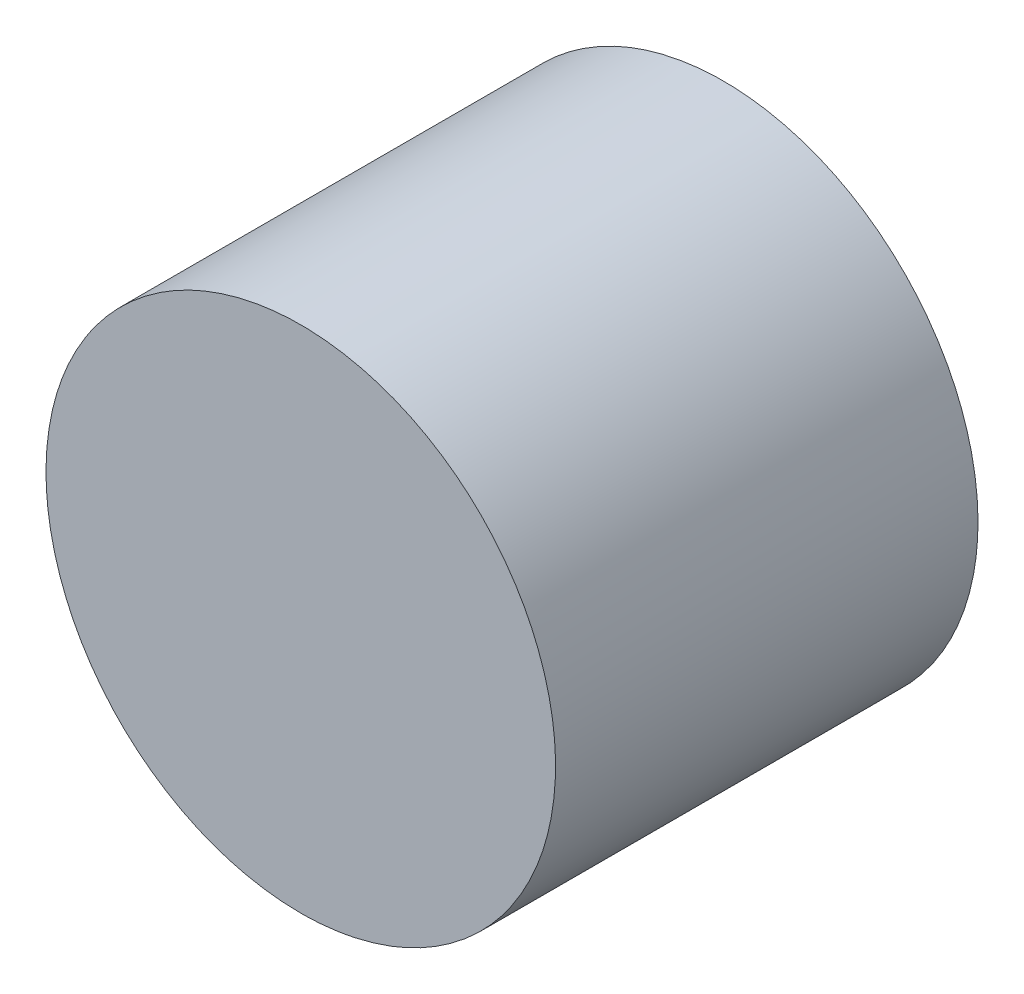
ISO-10303-21;
HEADER;
FILE_DESCRIPTION(('STEP AP214'),'2;1');
FILE_NAME('part.step','',(''),(''),'','','');
FILE_SCHEMA(('AUTOMOTIVE_DESIGN { 1 0 10303 214 1 1 1 1 }'));
ENDSEC;
DATA;
#1=APPLICATION_CONTEXT('core data for automotive mechanical design processes');
#2=APPLICATION_PROTOCOL_DEFINITION('international standard','automotive_design',2000,#1);
#3=PRODUCT_CONTEXT('',#1,'mechanical');
#4=PRODUCT('Part','Part','',(#3));
#5=PRODUCT_RELATED_PRODUCT_CATEGORY('part','',(#4));
#6=PRODUCT_DEFINITION_FORMATION('','',#4);
#7=PRODUCT_DEFINITION_CONTEXT('part definition',#1,'design');
#8=PRODUCT_DEFINITION('design','',#6,#7);
#9=PRODUCT_DEFINITION_SHAPE('','',#8);
#10=(LENGTH_UNIT() NAMED_UNIT(*) SI_UNIT(.MILLI.,.METRE.));
#11=(NAMED_UNIT(*) PLANE_ANGLE_UNIT() SI_UNIT($,.RADIAN.));
#12=(NAMED_UNIT(*) SI_UNIT($,.STERADIAN.) SOLID_ANGLE_UNIT());
#13=UNCERTAINTY_MEASURE_WITH_UNIT(LENGTH_MEASURE(1.E-05),#10,'distance_accuracy_value','');
#14=(GEOMETRIC_REPRESENTATION_CONTEXT(3) GLOBAL_UNCERTAINTY_ASSIGNED_CONTEXT((#13)) GLOBAL_UNIT_ASSIGNED_CONTEXT((#10,
#11,#12)) REPRESENTATION_CONTEXT('',''));
#15=CARTESIAN_POINT('',(0.,0.,0.));
#16=DIRECTION('',(0.,0.,1.));
#17=DIRECTION('',(1.,0.,0.));
#18=AXIS2_PLACEMENT_3D('',#15,#16,#17);
#19=CARTESIAN_POINT('',(-8.5999934574517,59.3566052942442,123.808385168912));
#20=CARTESIAN_POINT('',(-8.53270146576865,59.3566052942442,123.808385168912));
#21=CARTESIAN_POINT('',(-8.39811748240253,59.383375712987,123.808385168912));
#22=CARTESIAN_POINT('',(-8.22697529454433,59.4977292669606,123.808385168912));
#23=CARTESIAN_POINT('',(-8.11262174057071,59.6688714548188,123.808385168912));
#24=CARTESIAN_POINT('',(-8.07246611245661,59.870747429868,123.808385168912));
#25=CARTESIAN_POINT('',(-8.11262174057071,60.0726234049171,123.808385168912));
#26=CARTESIAN_POINT('',(-8.22697529454433,60.2437655927754,123.808385168912));
#27=CARTESIAN_POINT('',(-8.39811748240254,60.358119146749,123.808385168912));
#28=CARTESIAN_POINT('',(-8.5999934574517,60.3982747748631,123.808385168912));
#29=CARTESIAN_POINT('',(-8.80186943250087,60.358119146749,123.808385168912));
#30=CARTESIAN_POINT('',(-8.97301162035908,60.2437655927754,123.808385168912));
#31=CARTESIAN_POINT('',(-9.0873651743327,60.0726234049172,123.808385168912));
#32=CARTESIAN_POINT('',(-9.1275208024468,59.870747429868,123.808385168912));
#33=CARTESIAN_POINT('',(-9.0873651743327,59.6688714548188,123.808385168912));
#34=CARTESIAN_POINT('',(-8.97301162035908,59.4977292669606,123.808385168912));
#35=CARTESIAN_POINT('',(-8.80186943250087,59.383375712987,123.808385168912));
#36=CARTESIAN_POINT('',(-8.66728544913476,59.3566052942442,123.808385168912));
#37=CARTESIAN_POINT('',(-8.5999934574517,59.3566052942442,123.808385168912));
#38=B_SPLINE_CURVE_WITH_KNOTS('',3,(#19,#20,#21,#22,#23,#24,#25,#26,#27,#28,#29,#30,#31,#32,#33,
#34,#35,#36,#37),.UNSPECIFIED.,.T.,.F.,(4,1,1,1,1,1,1,1,1,1,1,1,1,1,1,1,4),(0.,
0.0625000000000002,0.125,0.187500000000001,0.25,0.312499999999999,0.375,0.4375,0.5,0.5625,0.625,
0.687500000000001,0.75,0.812499999999999,0.875,0.9375,1.),.UNSPECIFIED.);
#39=DIRECTION('',(0.,0.,1.));
#40=VECTOR('',#39,1.);
#41=SURFACE_OF_LINEAR_EXTRUSION('',#38,#40);
#42=CARTESIAN_POINT('',(-8.5999934574517,59.3566052942442,123.808385168912));
#43=CARTESIAN_POINT('',(-8.53270146576865,59.3566052942442,123.808385168912));
#44=CARTESIAN_POINT('',(-8.39811748240253,59.383375712987,123.808385168912));
#45=CARTESIAN_POINT('',(-8.22697529454433,59.4977292669606,123.808385168912));
#46=CARTESIAN_POINT('',(-8.11262174057071,59.6688714548188,123.808385168912));
#47=CARTESIAN_POINT('',(-8.07246611245661,59.870747429868,123.808385168912));
#48=CARTESIAN_POINT('',(-8.11262174057071,60.0726234049171,123.808385168912));
#49=CARTESIAN_POINT('',(-8.22697529454433,60.2437655927754,123.808385168912));
#50=CARTESIAN_POINT('',(-8.39811748240254,60.358119146749,123.808385168912));
#51=CARTESIAN_POINT('',(-8.5999934574517,60.3982747748631,123.808385168912));
#52=CARTESIAN_POINT('',(-8.80186943250087,60.358119146749,123.808385168912));
#53=CARTESIAN_POINT('',(-8.97301162035908,60.2437655927754,123.808385168912));
#54=CARTESIAN_POINT('',(-9.0873651743327,60.0726234049172,123.808385168912));
#55=CARTESIAN_POINT('',(-9.1275208024468,59.870747429868,123.808385168912));
#56=CARTESIAN_POINT('',(-9.0873651743327,59.6688714548188,123.808385168912));
#57=CARTESIAN_POINT('',(-8.97301162035908,59.4977292669606,123.808385168912));
#58=CARTESIAN_POINT('',(-8.80186943250087,59.383375712987,123.808385168912));
#59=CARTESIAN_POINT('',(-8.66728544913476,59.3566052942442,123.808385168912));
#60=CARTESIAN_POINT('',(-8.5999934574517,59.3566052942442,123.808385168912));
#61=B_SPLINE_CURVE_WITH_KNOTS('',3,(#42,#43,#44,#45,#46,#47,#48,#49,#50,#51,#52,#53,#54,#55,#56,
#57,#58,#59,#60),.UNSPECIFIED.,.T.,.F.,(4,1,1,1,1,1,1,1,1,1,1,1,1,1,1,1,4),(0.,
0.0625000000000002,0.125,0.187500000000001,0.25,0.312499999999999,0.375,0.4375,0.5,0.5625,0.625,
0.687500000000001,0.75,0.812499999999999,0.875,0.9375,1.),.UNSPECIFIED.);
#62=CARTESIAN_POINT('',(-8.5999934574517,59.3566052942442,123.808385168912));
#63=VERTEX_POINT('',#62);
#64=EDGE_CURVE('E9',#63,#63,#61,.T.);
#65=ORIENTED_EDGE('',*,*,#64,.T.);
#66=EDGE_LOOP('',(#65));
#67=FACE_BOUND('',#66,.T.);
#68=CARTESIAN_POINT('',(-8.5999934574517,59.3566052942442,124.660837467507));
#69=CARTESIAN_POINT('',(-8.60791032570006,59.3566052886788,124.660837467507));
#70=CARTESIAN_POINT('',(-8.61582705487645,59.3567905637446,124.660837467507));
#71=CARTESIAN_POINT('',(-8.63164383298798,59.3575283008755,124.660837467507));
#72=CARTESIAN_POINT('',(-8.63954388100349,59.3580807826804,124.660837467507));
#73=CARTESIAN_POINT('',(-8.65531055835132,59.3595496066018,124.660837467507));
#74=CARTESIAN_POINT('',(-8.66317718545135,59.360465972649,124.660837467507));
#75=CARTESIAN_POINT('',(-8.67886037983419,59.362659246466,124.660837467507));
#76=CARTESIAN_POINT('',(-8.68667694476544,59.363936171047,124.660837467507));
#77=CARTESIAN_POINT('',(-8.70224334390387,59.3668472604983,124.660837467507));
#78=CARTESIAN_POINT('',(-8.70999317743019,59.3684814290092,124.660837467507));
#79=CARTESIAN_POINT('',(-8.72540945393564,59.3721036952918,124.660837467507));
#80=CARTESIAN_POINT('',(-8.73307589938534,59.3740917825475,124.660837467507));
#81=CARTESIAN_POINT('',(-8.7483087124746,59.3784186324011,124.660837467507));
#82=CARTESIAN_POINT('',(-8.75587508601476,59.3807573742218,124.660837467507));
#83=CARTESIAN_POINT('',(-8.77089115704029,59.3857820662462,124.660837467507));
#84=CARTESIAN_POINT('',(-8.77834086202267,59.3884679940365,124.660837467507));
#85=CARTESIAN_POINT('',(-8.79310666797214,59.3941843627616,124.660837467507));
#86=CARTESIAN_POINT('',(-8.80042277317195,59.3972147927599,124.660837467507));
#87=CARTESIAN_POINT('',(-8.81490585777387,59.403613711184,124.660837467507));
#88=CARTESIAN_POINT('',(-8.82207283243561,59.4069822103361,124.660837467507));
#89=CARTESIAN_POINT('',(-8.83624379189913,59.4140471821933,124.660837467507));
#90=CARTESIAN_POINT('',(-8.84324776615349,59.4177436760481,124.660837467507));
#91=CARTESIAN_POINT('',(-8.85707853641886,59.4254553565625,124.660837467507));
#92=CARTESIAN_POINT('',(-8.86390532191062,59.4294705620861,124.660837467507));
#93=CARTESIAN_POINT('',(-8.87736760476604,59.4378101868597,124.660837467507));
#94=CARTESIAN_POINT('',(-8.88400309644064,59.4421346152928,124.660837467507));
#95=CARTESIAN_POINT('',(-8.89706865337682,59.4510832699645,124.660837467507));
#96=CARTESIAN_POINT('',(-8.90349872073123,59.4557074931475,124.660837467507));
#97=CARTESIAN_POINT('',(-8.91613929465255,59.4652463097937,124.660837467507));
#98=CARTESIAN_POINT('',(-8.92234981144379,59.4701608897066,124.660837467507));
#99=CARTESIAN_POINT('',(-8.93453714367976,59.4802709901018,124.660837467507));
#100=CARTESIAN_POINT('',(-8.94051397446834,59.485466492085,124.660837467507));
#101=CARTESIAN_POINT('',(-8.95221981277431,59.4961290167532,124.660837467507));
#102=CARTESIAN_POINT('',(-8.95794883359694,59.5015960248267,124.660837467507));
#103=CARTESIAN_POINT('',(-8.96914486249302,59.5127920537227,124.660837467507));
#104=CARTESIAN_POINT('',(-8.97461187056649,59.5185210745454,124.660837467507));
#105=CARTESIAN_POINT('',(-8.98527439523464,59.5302269128513,124.660837467507));
#106=CARTESIAN_POINT('',(-8.99046989721789,59.5362037436399,124.660837467507));
#107=CARTESIAN_POINT('',(-9.00057999761304,59.5483910758759,124.660837467507));
#108=CARTESIAN_POINT('',(-9.005494577526,59.5546015926671,124.660837467507));
#109=CARTESIAN_POINT('',(-9.01503339417222,59.5672421665884,124.660837467507));
#110=CARTESIAN_POINT('',(-9.01965761735519,59.5736722339429,124.660837467507));
#111=CARTESIAN_POINT('',(-9.02860627202692,59.586737790879,124.660837467507));
#112=CARTESIAN_POINT('',(-9.03293070045995,59.5933732825537,124.660837467507));
#113=CARTESIAN_POINT('',(-9.04127032523362,59.606835565409,124.660837467507));
#114=CARTESIAN_POINT('',(-9.0452855307572,59.6136623509008,124.660837467507));
#115=CARTESIAN_POINT('',(-9.05299721127161,59.6274931211662,124.660837467507));
#116=CARTESIAN_POINT('',(-9.05669370512638,59.6344970954207,124.660837467507));
#117=CARTESIAN_POINT('',(-9.06375867698356,59.6486680548839,124.660837467507));
#118=CARTESIAN_POINT('',(-9.06712717613576,59.6558350295452,124.660837467507));
#119=CARTESIAN_POINT('',(-9.07352609455977,59.6703181141483,124.660837467507));
#120=CARTESIAN_POINT('',(-9.07655652455793,59.6776342193497,124.660837467507));
#121=CARTESIAN_POINT('',(-9.08227289328337,59.6924000252949,124.660837467507));
#122=CARTESIAN_POINT('',(-9.08495882107404,59.6998497302714,124.660837467507));
#123=CARTESIAN_POINT('',(-9.0899835130973,59.7148658013129,124.660837467507));
#124=CARTESIAN_POINT('',(-9.09232225491657,59.7224321748748,124.660837467507));
#125=CARTESIAN_POINT('',(-9.09664910477422,59.7376649879046,124.660837467507));
#126=CARTESIAN_POINT('',(-9.09863719203554,59.7453314332731,124.660837467507));
#127=CARTESIAN_POINT('',(-9.10225945830283,59.7607477100004,124.660837467507));
#128=CARTESIAN_POINT('',(-9.1038936267927,59.7684975438298,124.660837467507));
#129=CARTESIAN_POINT('',(-9.10680471630138,59.7840639421402,124.660837467507));
#130=CARTESIAN_POINT('',(-9.10808164096077,59.7918805059404,124.660837467507));
#131=CARTESIAN_POINT('',(-9.11027491456358,59.8075637034133,124.660837467507));
#132=CARTESIAN_POINT('',(-9.11119128031822,59.8154303347342,124.660837467507));
#133=CARTESIAN_POINT('',(-9.11266010503895,59.8311970005507,124.660837467507));
#134=CARTESIAN_POINT('',(-9.11321258793553,59.8390970328154,124.660837467507));
#135=CARTESIAN_POINT('',(-9.11395032208375,59.8549138539584,124.660837467507));
#136=CARTESIAN_POINT('',(-9.11413559307544,59.8628306419132,124.660837467507));
#137=CARTESIAN_POINT('',(-9.11413559307544,59.8786642178228,124.660837467507));
#138=CARTESIAN_POINT('',(-9.11395032208375,59.8865810057775,124.660837467507));
#139=CARTESIAN_POINT('',(-9.11321258793553,59.9023978269206,124.660837467507));
#140=CARTESIAN_POINT('',(-9.11266010503895,59.9102978591852,124.660837467507));
#141=CARTESIAN_POINT('',(-9.11119128031821,59.9260645250017,124.660837467507));
#142=CARTESIAN_POINT('',(-9.11027491456358,59.9339311563226,124.660837467507));
#143=CARTESIAN_POINT('',(-9.10808164096077,59.9496143537955,124.660837467507));
#144=CARTESIAN_POINT('',(-9.10680471630138,59.9574309175957,124.660837467507));
#145=CARTESIAN_POINT('',(-9.1038936267927,59.9729973159062,124.660837467507));
#146=CARTESIAN_POINT('',(-9.10225945830283,59.9807471497355,124.660837467507));
#147=CARTESIAN_POINT('',(-9.09863719203554,59.9961634264628,124.660837467507));
#148=CARTESIAN_POINT('',(-9.09664910477422,60.0038298718313,124.660837467507));
#149=CARTESIAN_POINT('',(-9.09232225491657,60.0190626848612,124.660837467507));
#150=CARTESIAN_POINT('',(-9.0899835130973,60.0266290584231,124.660837467507));
#151=CARTESIAN_POINT('',(-9.08495882107404,60.0416451294645,124.660837467507));
#152=CARTESIAN_POINT('',(-9.08227289328337,60.0490948344411,124.660837467507));
#153=CARTESIAN_POINT('',(-9.07655652455792,60.0638606403863,124.660837467507));
#154=CARTESIAN_POINT('',(-9.07352609455977,60.0711767455877,124.660837467507));
#155=CARTESIAN_POINT('',(-9.06712717613576,60.0856598301907,124.660837467507));
#156=CARTESIAN_POINT('',(-9.06375867698356,60.092826804852,124.660837467507));
#157=CARTESIAN_POINT('',(-9.05669370512638,60.1069977643153,124.660837467507));
#158=CARTESIAN_POINT('',(-9.05299721127161,60.1140017385697,124.660837467507));
#159=CARTESIAN_POINT('',(-9.0452855307572,60.1278325088352,124.660837467507));
#160=CARTESIAN_POINT('',(-9.04127032523362,60.1346592943269,124.660837467507));
#161=CARTESIAN_POINT('',(-9.03293070045995,60.1481215771823,124.660837467507));
#162=CARTESIAN_POINT('',(-9.02860627202691,60.1547570688569,124.660837467507));
#163=CARTESIAN_POINT('',(-9.01965761735518,60.1678226257931,124.660837467507));
#164=CARTESIAN_POINT('',(-9.01503339417221,60.1742526931475,124.660837467507));
#165=CARTESIAN_POINT('',(-9.005494577526,60.1868932670688,124.660837467507));
#166=CARTESIAN_POINT('',(-9.00057999761304,60.1931037838601,124.660837467507));
#167=CARTESIAN_POINT('',(-8.99046989721789,60.205291116096,124.660837467507));
#168=CARTESIAN_POINT('',(-8.98527439523464,60.2112679468846,124.660837467507));
#169=CARTESIAN_POINT('',(-8.97461187056649,60.2229737851906,124.660837467507));
#170=CARTESIAN_POINT('',(-8.96914486249302,60.2287028060132,124.660837467507));
#171=CARTESIAN_POINT('',(-8.95794883359694,60.2398988349093,124.660837467507));
#172=CARTESIAN_POINT('',(-8.95221981277431,60.2453658429828,124.660837467507));
#173=CARTESIAN_POINT('',(-8.94051397446833,60.2560283676509,124.660837467507));
#174=CARTESIAN_POINT('',(-8.93453714367975,60.2612238696342,124.660837467507));
#175=CARTESIAN_POINT('',(-8.92234981144379,60.2713339700293,124.660837467507));
#176=CARTESIAN_POINT('',(-8.91613929465254,60.2762485499423,124.660837467507));
#177=CARTESIAN_POINT('',(-8.90349872073123,60.2857873665885,124.660837467507));
#178=CARTESIAN_POINT('',(-8.89706865337682,60.2904115897715,124.660837467507));
#179=CARTESIAN_POINT('',(-8.88400309644064,60.2993602444432,124.660837467507));
#180=CARTESIAN_POINT('',(-8.87736760476603,60.3036846728762,124.660837467507));
#181=CARTESIAN_POINT('',(-8.86390532191063,60.3120242976499,124.660837467507));
#182=CARTESIAN_POINT('',(-8.8570785364189,60.3160395031735,124.660837467507));
#183=CARTESIAN_POINT('',(-8.84324776615345,60.3237511836879,124.660837467507));
#184=CARTESIAN_POINT('',(-8.83624379189898,60.3274476775427,124.660837467507));
#185=CARTESIAN_POINT('',(-8.82207283243576,60.3345126493998,124.660837467507));
#186=CARTESIAN_POINT('',(-8.81490585777444,60.3378811485521,124.660837467507));
#187=CARTESIAN_POINT('',(-8.80042277317138,60.344280066976,124.660837467507));
#188=CARTESIAN_POINT('',(-8.79310666797,60.3473104969742,124.660837467507));
#189=CARTESIAN_POINT('',(-8.77834086202481,60.3530268656996,124.660837467507));
#190=CARTESIAN_POINT('',(-8.77089115704825,60.3557127934903,124.660837467507));
#191=CARTESIAN_POINT('',(-8.75587508600679,60.3607374855136,124.660837467507));
#192=CARTESIAN_POINT('',(-8.74830871244488,60.3630762273328,124.660837467507));
#193=CARTESIAN_POINT('',(-8.73307589941505,60.3674030771905,124.660837467507));
#194=CARTESIAN_POINT('',(-8.72540945404656,60.3693911644518,124.660837467507));
#195=CARTESIAN_POINT('',(-8.70999317731925,60.3730134307191,124.660837467507));
#196=CARTESIAN_POINT('',(-8.70224334348987,60.374647599209,124.660837467507));
#197=CARTESIAN_POINT('',(-8.68667694517944,60.3775586887177,124.660837467507));
#198=CARTESIAN_POINT('',(-8.67886038137925,60.3788356133771,124.660837467507));
#199=CARTESIAN_POINT('',(-8.66317718390636,60.3810288869799,124.660837467507));
#200=CARTESIAN_POINT('',(-8.65531055258547,60.3819452527345,124.660837467507));
#201=CARTESIAN_POINT('',(-8.63954388676895,60.3834140774552,124.660837467507));
#202=CARTESIAN_POINT('',(-8.63164385450432,60.3839665603518,124.660837467507));
#203=CARTESIAN_POINT('',(-8.61582703336127,60.3847042945,124.660837467507));
#204=CARTESIAN_POINT('',(-8.60791024540649,60.3848895654917,124.660837467507));
#205=CARTESIAN_POINT('',(-8.59207666949692,60.3848895654917,124.660837467507));
#206=CARTESIAN_POINT('',(-8.58415988154214,60.3847042945,124.660837467507));
#207=CARTESIAN_POINT('',(-8.56834306039909,60.3839665603518,124.660837467507));
#208=CARTESIAN_POINT('',(-8.56044302813446,60.3834140774552,124.660837467507));
#209=CARTESIAN_POINT('',(-8.54467636231794,60.3819452527345,124.660837467507));
#210=CARTESIAN_POINT('',(-8.53680973099705,60.3810288869799,124.660837467507));
#211=CARTESIAN_POINT('',(-8.52112653352416,60.378835613377,124.660837467507));
#212=CARTESIAN_POINT('',(-8.51330996972397,60.3775586887177,124.660837467507));
#213=CARTESIAN_POINT('',(-8.49774357141354,60.374647599209,124.660837467507));
#214=CARTESIAN_POINT('',(-8.48999373758416,60.3730134307191,124.660837467507));
#215=CARTESIAN_POINT('',(-8.47457746085685,60.3693911644518,124.660837467507));
#216=CARTESIAN_POINT('',(-8.46691101548835,60.3674030771905,124.660837467507));
#217=CARTESIAN_POINT('',(-8.45167820245853,60.3630762273329,124.660837467507));
#218=CARTESIAN_POINT('',(-8.44411182889661,60.3607374855136,124.660837467507));
#219=CARTESIAN_POINT('',(-8.42909575785516,60.3557127934903,124.660837467507));
#220=CARTESIAN_POINT('',(-8.42164605287861,60.3530268656996,124.660837467507));
#221=CARTESIAN_POINT('',(-8.4068802469334,60.3473104969742,124.660837467507));
#222=CARTESIAN_POINT('',(-8.39956414173203,60.3442800669761,124.660837467507));
#223=CARTESIAN_POINT('',(-8.38508105712897,60.337881148552,124.660837467507));
#224=CARTESIAN_POINT('',(-8.37791408246765,60.3345126493998,124.660837467507));
#225=CARTESIAN_POINT('',(-8.36374312300443,60.3274476775427,124.660837467507));
#226=CARTESIAN_POINT('',(-8.35673914874996,60.3237511836879,124.660837467507));
#227=CARTESIAN_POINT('',(-8.34290837848451,60.3160395031735,124.660837467507));
#228=CARTESIAN_POINT('',(-8.33608159299278,60.3120242976499,124.660837467507));
#229=CARTESIAN_POINT('',(-8.32261931013739,60.3036846728762,124.660837467507));
#230=CARTESIAN_POINT('',(-8.31598381846277,60.2993602444432,124.660837467507));
#231=CARTESIAN_POINT('',(-8.30291826152659,60.2904115897715,124.660837467507));
#232=CARTESIAN_POINT('',(-8.29648819417218,60.2857873665885,124.660837467507));
#233=CARTESIAN_POINT('',(-8.28384762025087,60.2762485499423,124.660837467507));
#234=CARTESIAN_POINT('',(-8.27763710345962,60.2713339700293,124.660837467507));
#235=CARTESIAN_POINT('',(-8.26544977122365,60.2612238696342,124.660837467507));
#236=CARTESIAN_POINT('',(-8.25947294043507,60.2560283676509,124.660837467507));
#237=CARTESIAN_POINT('',(-8.24776710212909,60.2453658429828,124.660837467507));
#238=CARTESIAN_POINT('',(-8.24203808130647,60.2398988349093,124.660837467507));
#239=CARTESIAN_POINT('',(-8.23084205241039,60.2287028060132,124.660837467507));
#240=CARTESIAN_POINT('',(-8.22537504433692,60.2229737851906,124.660837467507));
#241=CARTESIAN_POINT('',(-8.21471251966877,60.2112679468846,124.660837467507));
#242=CARTESIAN_POINT('',(-8.20951701768552,60.205291116096,124.660837467507));
#243=CARTESIAN_POINT('',(-8.19940691729037,60.1931037838601,124.660837467507));
#244=CARTESIAN_POINT('',(-8.19449233737741,60.1868932670688,124.660837467507));
#245=CARTESIAN_POINT('',(-8.1849535207312,60.1742526931475,124.660837467507));
#246=CARTESIAN_POINT('',(-8.18032929754823,60.1678226257931,124.660837467507));
#247=CARTESIAN_POINT('',(-8.1713806428765,60.1547570688569,124.660837467507));
#248=CARTESIAN_POINT('',(-8.16705621444346,60.1481215771823,124.660837467507));
#249=CARTESIAN_POINT('',(-8.15871658966979,60.1346592943269,124.660837467507));
#250=CARTESIAN_POINT('',(-8.15470138414621,60.1278325088352,124.660837467507));
#251=CARTESIAN_POINT('',(-8.1469897036318,60.1140017385697,124.660837467507));
#252=CARTESIAN_POINT('',(-8.14329320977702,60.1069977643152,124.660837467507));
#253=CARTESIAN_POINT('',(-8.13622823791985,60.092826804852,124.660837467507));
#254=CARTESIAN_POINT('',(-8.13285973876765,60.0856598301907,124.660837467507));
#255=CARTESIAN_POINT('',(-8.12646082034364,60.0711767455876,124.660837467507));
#256=CARTESIAN_POINT('',(-8.12343039034549,60.0638606403863,124.660837467507));
#257=CARTESIAN_POINT('',(-8.11771402162004,60.0490948344411,124.660837467507));
#258=CARTESIAN_POINT('',(-8.11502809382937,60.0416451294645,124.660837467507));
#259=CARTESIAN_POINT('',(-8.11000340180611,60.0266290584231,124.660837467507));
#260=CARTESIAN_POINT('',(-8.10766465998684,60.0190626848611,124.660837467507));
#261=CARTESIAN_POINT('',(-8.1033378101292,60.0038298718313,124.660837467507));
#262=CARTESIAN_POINT('',(-8.10134972286787,59.9961634264628,124.660837467507));
#263=CARTESIAN_POINT('',(-8.09772745660058,59.9807471497355,124.660837467507));
#264=CARTESIAN_POINT('',(-8.09609328811071,59.9729973159061,124.660837467507));
#265=CARTESIAN_POINT('',(-8.09318219860203,59.9574309175957,124.660837467507));
#266=CARTESIAN_POINT('',(-8.09190527394264,59.9496143537955,124.660837467507));
#267=CARTESIAN_POINT('',(-8.08971200033983,59.9339311563226,124.660837467507));
#268=CARTESIAN_POINT('',(-8.0887956345852,59.9260645250017,124.660837467507));
#269=CARTESIAN_POINT('',(-8.08732680986446,59.9102978591852,124.660837467507));
#270=CARTESIAN_POINT('',(-8.08677432696788,59.9023978269206,124.660837467507));
#271=CARTESIAN_POINT('',(-8.08603659281966,59.8865810057775,124.660837467507));
#272=CARTESIAN_POINT('',(-8.08585132182798,59.8786642178228,124.660837467507));
#273=CARTESIAN_POINT('',(-8.08585132182798,59.8628306419132,124.660837467507));
#274=CARTESIAN_POINT('',(-8.08603659281967,59.8549138539584,124.660837467507));
#275=CARTESIAN_POINT('',(-8.08677432696788,59.8390970328154,124.660837467507));
#276=CARTESIAN_POINT('',(-8.08732680986446,59.8311970005507,124.660837467507));
#277=CARTESIAN_POINT('',(-8.0887956345852,59.8154303347342,124.660837467507));
#278=CARTESIAN_POINT('',(-8.08971200033983,59.8075637034133,124.660837467507));
#279=CARTESIAN_POINT('',(-8.09190527394264,59.7918805059404,124.660837467507));
#280=CARTESIAN_POINT('',(-8.09318219860203,59.7840639421402,124.660837467507));
#281=CARTESIAN_POINT('',(-8.09609328811071,59.7684975438298,124.660837467507));
#282=CARTESIAN_POINT('',(-8.09772745660058,59.7607477100004,124.660837467507));
#283=CARTESIAN_POINT('',(-8.10134972286787,59.7453314332731,124.660837467507));
#284=CARTESIAN_POINT('',(-8.1033378101292,59.7376649879046,124.660837467507));
#285=CARTESIAN_POINT('',(-8.10766465998684,59.7224321748748,124.660837467507));
#286=CARTESIAN_POINT('',(-8.11000340180611,59.7148658013129,124.660837467507));
#287=CARTESIAN_POINT('',(-8.11502809382937,59.6998497302714,124.660837467507));
#288=CARTESIAN_POINT('',(-8.11771402162004,59.6924000252949,124.660837467507));
#289=CARTESIAN_POINT('',(-8.12343039034548,59.6776342193497,124.660837467507));
#290=CARTESIAN_POINT('',(-8.12646082034364,59.6703181141483,124.660837467507));
#291=CARTESIAN_POINT('',(-8.13285973876765,59.6558350295452,124.660837467507));
#292=CARTESIAN_POINT('',(-8.13622823791985,59.6486680548839,124.660837467507));
#293=CARTESIAN_POINT('',(-8.14329320977703,59.6344970954207,124.660837467507));
#294=CARTESIAN_POINT('',(-8.1469897036318,59.6274931211662,124.660837467507));
#295=CARTESIAN_POINT('',(-8.15470138414621,59.6136623509008,124.660837467507));
#296=CARTESIAN_POINT('',(-8.1587165896698,59.6068355654091,124.660837467507));
#297=CARTESIAN_POINT('',(-8.16705621444346,59.5933732825537,124.660837467507));
#298=CARTESIAN_POINT('',(-8.17138064287649,59.586737790879,124.660837467507));
#299=CARTESIAN_POINT('',(-8.18032929754823,59.5736722339429,124.660837467507));
#300=CARTESIAN_POINT('',(-8.1849535207312,59.5672421665885,124.660837467507));
#301=CARTESIAN_POINT('',(-8.19449233737742,59.5546015926671,124.660837467507));
#302=CARTESIAN_POINT('',(-8.19940691729037,59.5483910758759,124.660837467507));
#303=CARTESIAN_POINT('',(-8.20951701768552,59.5362037436399,124.660837467507));
#304=CARTESIAN_POINT('',(-8.21471251966877,59.5302269128513,124.660837467507));
#305=CARTESIAN_POINT('',(-8.22537504433693,59.5185210745454,124.660837467507));
#306=CARTESIAN_POINT('',(-8.23084205241039,59.5127920537228,124.660837467507));
#307=CARTESIAN_POINT('',(-8.24203808130647,59.5015960248267,124.660837467507));
#308=CARTESIAN_POINT('',(-8.24776710212909,59.4961290167532,124.660837467507));
#309=CARTESIAN_POINT('',(-8.25947294043508,59.485466492085,124.660837467507));
#310=CARTESIAN_POINT('',(-8.26544977122366,59.4802709901018,124.660837467507));
#311=CARTESIAN_POINT('',(-8.27763710345962,59.4701608897066,124.660837467507));
#312=CARTESIAN_POINT('',(-8.28384762025087,59.4652463097937,124.660837467507));
#313=CARTESIAN_POINT('',(-8.29648819417218,59.4557074931475,124.660837467507));
#314=CARTESIAN_POINT('',(-8.30291826152659,59.4510832699645,124.660837467507));
#315=CARTESIAN_POINT('',(-8.31598381846277,59.4421346152928,124.660837467507));
#316=CARTESIAN_POINT('',(-8.32261931013737,59.4378101868597,124.660837467507));
#317=CARTESIAN_POINT('',(-8.33608159299279,59.4294705620861,124.660837467507));
#318=CARTESIAN_POINT('',(-8.34290837848455,59.4254553565625,124.660837467507));
#319=CARTESIAN_POINT('',(-8.35673914874992,59.4177436760481,124.660837467507));
#320=CARTESIAN_POINT('',(-8.36374312300428,59.4140471821933,124.660837467507));
#321=CARTESIAN_POINT('',(-8.3779140824678,59.4069822103361,124.660837467507));
#322=CARTESIAN_POINT('',(-8.38508105712954,59.403613711184,124.660837467507));
#323=CARTESIAN_POINT('',(-8.39956414173146,59.3972147927599,124.660837467507));
#324=CARTESIAN_POINT('',(-8.40688024693127,59.3941843627616,124.660837467507));
#325=CARTESIAN_POINT('',(-8.42164605288074,59.3884679940365,124.660837467507));
#326=CARTESIAN_POINT('',(-8.42909575786312,59.3857820662462,124.660837467507));
#327=CARTESIAN_POINT('',(-8.44411182888865,59.3807573742218,124.660837467507));
#328=CARTESIAN_POINT('',(-8.45167820242881,59.378418632401,124.660837467507));
#329=CARTESIAN_POINT('',(-8.46691101551808,59.3740917825475,124.660837467507));
#330=CARTESIAN_POINT('',(-8.47457746096777,59.3721036952918,124.660837467507));
#331=CARTESIAN_POINT('',(-8.48999373747323,59.3684814290092,124.660837467507));
#332=CARTESIAN_POINT('',(-8.49774357099953,59.3668472604983,124.660837467507));
#333=CARTESIAN_POINT('',(-8.51330997013797,59.363936171047,124.660837467507));
#334=CARTESIAN_POINT('',(-8.52112653506922,59.362659246466,124.660837467507));
#335=CARTESIAN_POINT('',(-8.53680972945206,59.360465972649,124.660837467507));
#336=CARTESIAN_POINT('',(-8.54467635655209,59.3595496066018,124.660837467507));
#337=CARTESIAN_POINT('',(-8.56044303389993,59.3580807826804,124.660837467507));
#338=CARTESIAN_POINT('',(-8.56834308191543,59.3575283008755,124.660837467507));
#339=CARTESIAN_POINT('',(-8.58415986002696,59.3567905637446,124.660837467507));
#340=CARTESIAN_POINT('',(-8.59207658920335,59.3566052886788,124.660837467507));
#341=CARTESIAN_POINT('',(-8.5999934574517,59.3566052942442,124.660837467507));
#342=B_SPLINE_CURVE_WITH_KNOTS('',3,(#68,#69,#70,#71,#72,#73,#74,#75,#76,#77,#78,#79,#80,#81,
#82,#83,#84,#85,#86,#87,#88,#89,#90,#91,#92,#93,#94,#95,#96,#97,#98,#99,#100,#101,#102,#103,
#104,#105,#106,#107,#108,#109,#110,#111,#112,#113,#114,#115,#116,#117,#118,#119,#120,#121,#122,
#123,#124,#125,#126,#127,#128,#129,#130,#131,#132,#133,#134,#135,#136,#137,#138,#139,#140,#141,
#142,#143,#144,#145,#146,#147,#148,#149,#150,#151,#152,#153,#154,#155,#156,#157,#158,#159,#160,
#161,#162,#163,#164,#165,#166,#167,#168,#169,#170,#171,#172,#173,#174,#175,#176,#177,#178,#179,
#180,#181,#182,#183,#184,#185,#186,#187,#188,#189,#190,#191,#192,#193,#194,#195,#196,#197,#198,
#199,#200,#201,#202,#203,#204,#205,#206,#207,#208,#209,#210,#211,#212,#213,#214,#215,#216,#217,
#218,#219,#220,#221,#222,#223,#224,#225,#226,#227,#228,#229,#230,#231,#232,#233,#234,#235,#236,
#237,#238,#239,#240,#241,#242,#243,#244,#245,#246,#247,#248,#249,#250,#251,#252,#253,#254,#255,
#256,#257,#258,#259,#260,#261,#262,#263,#264,#265,#266,#267,#268,#269,#270,#271,#272,#273,#274,
#275,#276,#277,#278,#279,#280,#281,#282,#283,#284,#285,#286,#287,#288,#289,#290,#291,#292,#293,
#294,#295,#296,#297,#298,#299,#300,#301,#302,#303,#304,#305,#306,#307,#308,#309,#310,#311,#312,
#313,#314,#315,#316,#317,#318,#319,#320,#321,#322,#323,#324,#325,#326,#327,#328,#329,#330,#331,
#332,#333,#334,#335,#336,#337,#338,#339,#340,#341),.UNSPECIFIED.,.F.,.F.,(4,2,2,2,2,2,2,2,2,2,2,
2,2,2,2,2,2,2,2,2,2,2,2,2,2,2,2,2,2,2,2,2,2,2,2,2,2,2,2,2,2,2,2,2,2,2,2,2,2,2,2,2,2,2,2,2,2,2,2,
2,2,2,2,2,2,2,2,2,2,2,2,2,2,2,2,2,2,2,2,2,2,2,2,2,2,2,2,2,2,2,2,2,2,2,2,2,2,2,2,2,2,2,2,2,2,2,2,
2,2,2,2,2,2,2,2,2,2,2,2,2,2,2,2,2,2,2,2,2,2,2,2,2,2,2,2,2,4),(0.,0.0237482396435165,
0.0474977560144934,0.0712488345131884,0.0950010205986732,0.118753448747793,0.142505171251689,
0.166255486969868,0.190004270201622,0.213752299711633,0.237501082943389,0.261251398661558,
0.285003121165453,0.308755549314577,0.33250773540006,0.356258813898753,0.380008330269732,
0.403756569913247,0.427504809556755,0.451254325927742,0.475005404426434,0.498757590511918,
0.522510018661043,0.546261741164932,0.570012056883115,0.593760840114865,0.617508869624883,
0.641257652856634,0.665007968574803,0.688759691078708,0.712512119227812,0.736264305313306,
0.760015383811999,0.783764900182988,0.807513139826495,0.831261379470014,0.85501089584099,
0.878761974339683,0.902514160425177,0.926266588574294,0.950018311078193,0.973768626796362,
0.997517410028113,1.02126543953814,1.04501422276989,1.06876453848806,1.09251626099196,
1.11626868914107,1.14002087522656,1.16377195372524,1.18752147009623,1.21126970973975,
1.23501794938326,1.25876746575424,1.28251854425294,1.30627073033842,1.33002315848754,
1.35377488099143,1.37752519670961,1.40127397994137,1.42502200945138,1.44877079268314,
1.47252110840131,1.4962728309052,1.52002525905432,1.54377744513981,1.5675285236385,
1.59127804000948,1.615026279653,1.63877451929651,1.66252403566749,1.68627511416618,
1.71002730025167,1.73377972840079,1.75753145090468,1.78128176662286,1.80503054985461,
1.82877857936462,1.85252736259638,1.87627767831455,1.90002940081845,1.92378182896757,
1.94753401505306,1.97128509355175,1.99503460992273,2.01878284956624,2.04253108920976,
2.06628060558074,2.09003168407944,2.11378387016492,2.13753629831404,2.16128802081794,
2.18503833653611,2.20878711976788,2.23253514927788,2.25628393250964,2.2800342482278,
2.30378597073171,2.32753839888083,2.35129058496631,2.375041663465,2.39879117983598,
2.42253941947949,2.446287659123,2.47003717549399,2.49378825399268,2.51754044007817,
2.54129286822727,2.56504459073119,2.58879490644934,2.6125436896811,2.63629171919112,
2.66004050242288,2.68379081814105,2.70754254064495,2.73129496879407,2.75504715487954,
2.77879823337825,2.80254774974922,2.82629598939273,2.85004422903626,2.87379374540723,
2.89754482390593,2.92129700999141,2.94504943814053,2.96880116064443,2.9925514763626,
3.01630025959436,3.04004828910437,3.06379707233612,3.0875473880543,3.11129911055819,
3.13505153870732,3.1588037247928,3.18255480329149,3.20630431966247,3.23005255930599),.UNSPECIFIED.);
#343=CARTESIAN_POINT('',(-8.5999934574517,59.3566052942442,124.660837467507));
#344=VERTEX_POINT('',#343);
#345=EDGE_CURVE('E24',#344,#344,#342,.F.);
#346=ORIENTED_EDGE('',*,*,#345,.F.);
#347=EDGE_LOOP('',(#346));
#348=FACE_BOUND('',#347,.T.);
#349=ADVANCED_FACE('F14',(#67,#348),#41,.T.);
#350=CARTESIAN_POINT('',(16.7615136437524,68.1112006131999,123.808385168912));
#351=DIRECTION('',(0.,0.,1.));
#352=DIRECTION('',(0.,-1.,0.));
#353=AXIS2_PLACEMENT_3D('',#350,#351,#352);
#354=PLANE('',#353);
#355=ORIENTED_EDGE('',*,*,#64,.F.);
#356=EDGE_LOOP('',(#355));
#357=FACE_BOUND('',#356,.T.);
#358=ADVANCED_FACE('F62',(#357),#354,.F.);
#359=CARTESIAN_POINT('',(16.7615136437524,68.1112006131999,124.660837467507));
#360=DIRECTION('',(0.,0.,1.));
#361=DIRECTION('',(0.,-1.,0.));
#362=AXIS2_PLACEMENT_3D('',#359,#360,#361);
#363=PLANE('',#362);
#364=ORIENTED_EDGE('',*,*,#345,.T.);
#365=EDGE_LOOP('',(#364));
#366=FACE_BOUND('',#365,.T.);
#367=ADVANCED_FACE('F31',(#366),#363,.T.);
#368=CLOSED_SHELL('',(#349,#358,#367));
#369=MANIFOLD_SOLID_BREP('B1',#368);
#370=ADVANCED_BREP_SHAPE_REPRESENTATION('',(#18,#369),#14);
#371=SHAPE_DEFINITION_REPRESENTATION(#9,#370);
ENDSEC;
END-ISO-10303-21;
